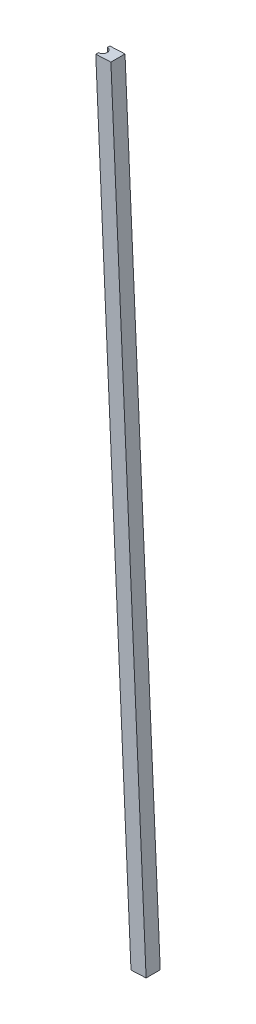
ISO-10303-21;
HEADER;
FILE_DESCRIPTION(('STEP AP214'),'2;1');
FILE_NAME('part.step','',(''),(''),'','','');
FILE_SCHEMA(('AUTOMOTIVE_DESIGN { 1 0 10303 214 1 1 1 1 }'));
ENDSEC;
DATA;
#1=APPLICATION_CONTEXT('core data for automotive mechanical design processes');
#2=APPLICATION_PROTOCOL_DEFINITION('international standard','automotive_design',2000,#1);
#3=PRODUCT_CONTEXT('',#1,'mechanical');
#4=PRODUCT('Part','Part','',(#3));
#5=PRODUCT_RELATED_PRODUCT_CATEGORY('part','',(#4));
#6=PRODUCT_DEFINITION_FORMATION('','',#4);
#7=PRODUCT_DEFINITION_CONTEXT('part definition',#1,'design');
#8=PRODUCT_DEFINITION('design','',#6,#7);
#9=PRODUCT_DEFINITION_SHAPE('','',#8);
#10=(LENGTH_UNIT() NAMED_UNIT(*) SI_UNIT(.MILLI.,.METRE.));
#11=(NAMED_UNIT(*) PLANE_ANGLE_UNIT() SI_UNIT($,.RADIAN.));
#12=(NAMED_UNIT(*) SI_UNIT($,.STERADIAN.) SOLID_ANGLE_UNIT());
#13=UNCERTAINTY_MEASURE_WITH_UNIT(LENGTH_MEASURE(1.E-05),#10,'distance_accuracy_value','');
#14=(GEOMETRIC_REPRESENTATION_CONTEXT(3) GLOBAL_UNCERTAINTY_ASSIGNED_CONTEXT((#13)) GLOBAL_UNIT_ASSIGNED_CONTEXT((#10,
#11,#12)) REPRESENTATION_CONTEXT('',''));
#15=CARTESIAN_POINT('',(0.,0.,0.));
#16=DIRECTION('',(0.,0.,1.));
#17=DIRECTION('',(1.,0.,0.));
#18=AXIS2_PLACEMENT_3D('',#15,#16,#17);
#19=CARTESIAN_POINT('',(-34.0668819369406,-273.797180723568,0.507891588204124));
#20=DIRECTION('',(-0.998970569790716,-0.0453629881292205,0.));
#21=DIRECTION('',(0.,0.,1.));
#22=AXIS2_PLACEMENT_3D('',#19,#20,#21);
#23=PLANE('',#22);
#24=DIRECTION('',(0.,0.,1.));
#25=VECTOR('',#24,1.);
#26=CARTESIAN_POINT('',(-45.8195249014578,-14.9838855021282,3.12419999999949));
#27=LINE('',#26,#25);
#28=CARTESIAN_POINT('',(-45.8195249014598,-14.9838855021284,1.65099999999818));
#29=VERTEX_POINT('',#28);
#30=CARTESIAN_POINT('',(-45.8195249014578,-14.9838855021282,0.8128));
#31=VERTEX_POINT('',#30);
#32=EDGE_CURVE('E68',#29,#31,#27,.F.);
#33=ORIENTED_EDGE('',*,*,#32,.T.);
#34=DIRECTION('',(-0.045362988129241,0.998970569790715,0.));
#35=VECTOR('',#34,1.);
#36=CARTESIAN_POINT('',(-40.0584254090455,-141.853147865521,0.8128));
#37=LINE('',#36,#35);
#38=CARTESIAN_POINT('',(-34.2973259166352,-268.72241022897,0.8128));
#39=VERTEX_POINT('',#38);
#40=EDGE_CURVE('E93',#31,#39,#37,.F.);
#41=ORIENTED_EDGE('',*,*,#40,.T.);
#42=DIRECTION('',(0.,0.,1.));
#43=VECTOR('',#42,1.);
#44=CARTESIAN_POINT('',(-34.2973259166391,-268.722410228985,1.2319));
#45=LINE('',#44,#43);
#46=CARTESIAN_POINT('',(-34.2973259166391,-268.722410228985,1.65100000000182));
#47=VERTEX_POINT('',#46);
#48=EDGE_CURVE('E107',#47,#39,#45,.F.);
#49=ORIENTED_EDGE('',*,*,#48,.F.);
#50=DIRECTION('',(0.0453629881292205,-0.998970569790716,0.));
#51=VECTOR('',#50,1.);
#52=CARTESIAN_POINT('',(-40.0584254090494,-141.85314786558,1.651));
#53=LINE('',#52,#51);
#54=EDGE_CURVE('E92',#47,#29,#53,.F.);
#55=ORIENTED_EDGE('',*,*,#54,.T.);
#56=EDGE_LOOP('',(#33,#41,#49,#55));
#57=FACE_BOUND('',#56,.T.);
#58=ADVANCED_FACE('F17',(#57),#23,.T.);
#59=CARTESIAN_POINT('',(-34.0668819369406,-273.797180723568,4.29249158820514));
#60=DIRECTION('',(-0.998970569790716,-0.0453629881292205,0.));
#61=DIRECTION('',(0.,0.,1.));
#62=AXIS2_PLACEMENT_3D('',#59,#60,#61);
#63=PLANE('',#62);
#64=DIRECTION('',(0.,0.,1.));
#65=VECTOR('',#64,1.);
#66=CARTESIAN_POINT('',(-45.8195249014578,-14.9838855021282,3.12419999999949));
#67=LINE('',#66,#65);
#68=CARTESIAN_POINT('',(-45.8195249014578,-14.9838855021282,5.4356));
#69=VERTEX_POINT('',#68);
#70=CARTESIAN_POINT('',(-45.8195249014578,-14.9838855021283,4.59739999999455));
#71=VERTEX_POINT('',#70);
#72=EDGE_CURVE('E74',#69,#71,#67,.F.);
#73=ORIENTED_EDGE('',*,*,#72,.T.);
#74=DIRECTION('',(-0.0453629881307493,0.998970569790647,0.));
#75=VECTOR('',#74,1.);
#76=CARTESIAN_POINT('',(-40.0584254088513,-141.853147865571,4.5974));
#77=LINE('',#76,#75);
#78=CARTESIAN_POINT('',(-34.297325916443,-268.722410228976,4.59739999999818));
#79=VERTEX_POINT('',#78);
#80=EDGE_CURVE('E77',#71,#79,#77,.F.);
#81=ORIENTED_EDGE('',*,*,#80,.T.);
#82=DIRECTION('',(0.,0.,1.));
#83=VECTOR('',#82,1.);
#84=CARTESIAN_POINT('',(-34.2973259166391,-268.722410228985,5.0165));
#85=LINE('',#84,#83);
#86=CARTESIAN_POINT('',(-34.2973259166294,-268.72241022894,5.4356));
#87=VERTEX_POINT('',#86);
#88=EDGE_CURVE('E82',#87,#79,#85,.F.);
#89=ORIENTED_EDGE('',*,*,#88,.F.);
#90=DIRECTION('',(0.0453629881292411,-0.998970569790715,0.));
#91=VECTOR('',#90,1.);
#92=CARTESIAN_POINT('',(-40.0584254090312,-141.85314786552,5.4356));
#93=LINE('',#92,#91);
#94=EDGE_CURVE('E80',#87,#69,#93,.F.);
#95=ORIENTED_EDGE('',*,*,#94,.T.);
#96=EDGE_LOOP('',(#73,#81,#89,#95));
#97=FACE_BOUND('',#96,.T.);
#98=ADVANCED_FACE('F76',(#97),#63,.T.);
#99=CARTESIAN_POINT('',(-40.5670291394142,-14.7453710652593,5.74050841179486));
#100=DIRECTION('',(-0.0453629881291912,0.998970569790718,0.));
#101=DIRECTION('',(0.,0.,-1.));
#102=AXIS2_PLACEMENT_3D('',#99,#100,#101);
#103=PLANE('',#102);
#104=CARTESIAN_POINT('',(-45.8195249016281,-14.983885502136,3.12419999999273));
#105=DIRECTION('',(-0.0453629881299678,0.998970569790682,0.));
#106=DIRECTION('',(-0.998970569790682,-0.0453629881299678,0.));
#107=AXIS2_PLACEMENT_3D('',#104,#105,#106);
#108=CIRCLE('',#107,1.47319999999636);
#109=EDGE_CURVE('E21',#29,#71,#108,.F.);
#110=ORIENTED_EDGE('',*,*,#109,.T.);
#111=ORIENTED_EDGE('',*,*,#72,.F.);
#112=DIRECTION('',(-0.998970569790729,-0.0453629881289418,0.));
#113=VECTOR('',#112,1.);
#114=CARTESIAN_POINT('',(-43.3455742853647,-14.8715440620268,5.4356));
#115=LINE('',#114,#113);
#116=CARTESIAN_POINT('',(-40.87162366929,-14.7592026219252,5.4356));
#117=VERTEX_POINT('',#116);
#118=EDGE_CURVE('E118',#69,#117,#115,.F.);
#119=ORIENTED_EDGE('',*,*,#118,.T.);
#120=DIRECTION('',(0.,0.,1.));
#121=VECTOR('',#120,1.);
#122=CARTESIAN_POINT('',(-40.8716236692926,-14.7592026219245,3.12419999999949));
#123=LINE('',#122,#121);
#124=CARTESIAN_POINT('',(-40.8716236692838,-14.7592026219242,0.8128));
#125=VERTEX_POINT('',#124);
#126=EDGE_CURVE('E137',#117,#125,#123,.F.);
#127=ORIENTED_EDGE('',*,*,#126,.T.);
#128=DIRECTION('',(0.998970569790729,0.0453629881289419,0.));
#129=VECTOR('',#128,1.);
#130=CARTESIAN_POINT('',(-43.3455742853648,-14.8715440620252,0.8128));
#131=LINE('',#130,#129);
#132=EDGE_CURVE('E97',#125,#31,#131,.F.);
#133=ORIENTED_EDGE('',*,*,#132,.T.);
#134=ORIENTED_EDGE('',*,*,#32,.F.);
#135=EDGE_LOOP('',(#110,#111,#119,#127,#133,#134));
#136=FACE_BOUND('',#135,.T.);
#137=ADVANCED_FACE('F91',(#136),#103,.T.);
#138=CARTESIAN_POINT('',(-28.814386174897,-273.558666286704,0.8128));
#139=DIRECTION('',(0.,0.,-1.));
#140=DIRECTION('',(-0.998970569791785,-0.0453629881056857,0.));
#141=AXIS2_PLACEMENT_3D('',#138,#139,#140);
#142=PLANE('',#141);
#143=ORIENTED_EDGE('',*,*,#132,.F.);
#144=DIRECTION('',(-0.0453629881293373,0.998970569790711,0.));
#145=VECTOR('',#144,1.);
#146=CARTESIAN_POINT('',(-35.1105241768681,-141.628464985315,0.8128));
#147=LINE('',#146,#145);
#148=CARTESIAN_POINT('',(-29.34942468444,-268.497727348806,0.8128));
#149=VERTEX_POINT('',#148);
#150=EDGE_CURVE('E132',#125,#149,#147,.F.);
#151=ORIENTED_EDGE('',*,*,#150,.T.);
#152=DIRECTION('',(-0.998970569791783,-0.0453629881057157,0.));
#153=VECTOR('',#152,1.);
#154=CARTESIAN_POINT('',(-31.823375300544,-268.610068788821,0.812800000000001));
#155=LINE('',#154,#153);
#156=EDGE_CURVE('E129',#149,#39,#155,.T.);
#157=ORIENTED_EDGE('',*,*,#156,.T.);
#158=ORIENTED_EDGE('',*,*,#40,.F.);
#159=EDGE_LOOP('',(#143,#151,#157,#158));
#160=FACE_BOUND('',#159,.T.);
#161=ADVANCED_FACE('F147',(#160),#142,.T.);
#162=CARTESIAN_POINT('',(-34.2973259166156,-268.722410228984,3.1242));
#163=DIRECTION('',(-0.0453629881299678,0.998970569790682,0.));
#164=DIRECTION('',(-0.998970569790682,-0.0453629881299678,0.));
#165=AXIS2_PLACEMENT_3D('',#162,#163,#164);
#166=CYLINDRICAL_SURFACE('',#165,1.47319999999636);
#167=ORIENTED_EDGE('',*,*,#109,.F.);
#168=ORIENTED_EDGE('',*,*,#54,.F.);
#169=CARTESIAN_POINT('',(-34.2973259166156,-268.722410228984,3.1242));
#170=DIRECTION('',(-0.0453629881299678,0.998970569790682,0.));
#171=DIRECTION('',(-0.998970569790682,-0.0453629881299678,0.));
#172=AXIS2_PLACEMENT_3D('',#169,#170,#171);
#173=CIRCLE('',#172,1.47319999999636);
#174=EDGE_CURVE('E89',#47,#79,#173,.F.);
#175=ORIENTED_EDGE('',*,*,#174,.T.);
#176=ORIENTED_EDGE('',*,*,#80,.F.);
#177=EDGE_LOOP('',(#167,#168,#175,#176));
#178=FACE_BOUND('',#177,.T.);
#179=ADVANCED_FACE('F85',(#178),#166,.F.);
#180=CARTESIAN_POINT('',(-34.3714764667902,-273.811012280106,5.4356));
#181=DIRECTION('',(0.,0.,1.));
#182=DIRECTION('',(0.998970569791785,0.0453629881056857,0.));
#183=AXIS2_PLACEMENT_3D('',#180,#181,#182);
#184=PLANE('',#183);
#185=ORIENTED_EDGE('',*,*,#118,.F.);
#186=ORIENTED_EDGE('',*,*,#94,.F.);
#187=DIRECTION('',(0.998970569791783,0.0453629881057157,0.));
#188=VECTOR('',#187,1.);
#189=CARTESIAN_POINT('',(-31.823375300544,-268.610068788821,5.4356));
#190=LINE('',#189,#188);
#191=CARTESIAN_POINT('',(-29.3494246844578,-268.497727348688,5.4356));
#192=VERTEX_POINT('',#191);
#193=EDGE_CURVE('E27',#87,#192,#190,.T.);
#194=ORIENTED_EDGE('',*,*,#193,.T.);
#195=DIRECTION('',(0.0453629881293374,-0.998970569790711,0.));
#196=VECTOR('',#195,1.);
#197=CARTESIAN_POINT('',(-35.1105241768681,-141.628464985315,5.4356));
#198=LINE('',#197,#196);
#199=EDGE_CURVE('E35',#192,#117,#198,.F.);
#200=ORIENTED_EDGE('',*,*,#199,.T.);
#201=EDGE_LOOP('',(#185,#186,#194,#200));
#202=FACE_BOUND('',#201,.T.);
#203=ADVANCED_FACE('F143',(#202),#184,.T.);
#204=CARTESIAN_POINT('',(-29.1189807047466,-273.572497843242,5.74050841179486));
#205=DIRECTION('',(0.998970569790711,0.0453629881293373,0.));
#206=DIRECTION('',(0.,0.,-1.));
#207=AXIS2_PLACEMENT_3D('',#204,#205,#206);
#208=PLANE('',#207);
#209=ORIENTED_EDGE('',*,*,#126,.F.);
#210=ORIENTED_EDGE('',*,*,#199,.F.);
#211=DIRECTION('',(0.,0.,-1.));
#212=VECTOR('',#211,1.);
#213=CARTESIAN_POINT('',(-29.3494246844416,-268.497727348777,3.12419999999949));
#214=LINE('',#213,#212);
#215=EDGE_CURVE('E11',#192,#149,#214,.T.);
#216=ORIENTED_EDGE('',*,*,#215,.T.);
#217=ORIENTED_EDGE('',*,*,#150,.F.);
#218=EDGE_LOOP('',(#209,#210,#216,#217));
#219=FACE_BOUND('',#218,.T.);
#220=ADVANCED_FACE('F146',(#219),#208,.T.);
#221=CARTESIAN_POINT('',(-29.0448301545974,-268.48389579212,5.74050841179486));
#222=DIRECTION('',(-0.0453629881057157,0.998970569791784,0.));
#223=DIRECTION('',(0.,0.,-1.));
#224=AXIS2_PLACEMENT_3D('',#221,#222,#223);
#225=PLANE('',#224);
#226=ORIENTED_EDGE('',*,*,#193,.F.);
#227=ORIENTED_EDGE('',*,*,#88,.T.);
#228=ORIENTED_EDGE('',*,*,#174,.F.);
#229=ORIENTED_EDGE('',*,*,#48,.T.);
#230=ORIENTED_EDGE('',*,*,#156,.F.);
#231=ORIENTED_EDGE('',*,*,#215,.F.);
#232=EDGE_LOOP('',(#226,#227,#228,#229,#230,#231));
#233=FACE_BOUND('',#232,.T.);
#234=ADVANCED_FACE('F19',(#233),#225,.F.);
#235=CLOSED_SHELL('',(#58,#98,#137,#161,#179,#203,#220,#234));
#236=MANIFOLD_SOLID_BREP('B1',#235);
#237=ADVANCED_BREP_SHAPE_REPRESENTATION('',(#18,#236),#14);
#238=SHAPE_DEFINITION_REPRESENTATION(#9,#237);
ENDSEC;
END-ISO-10303-21;
